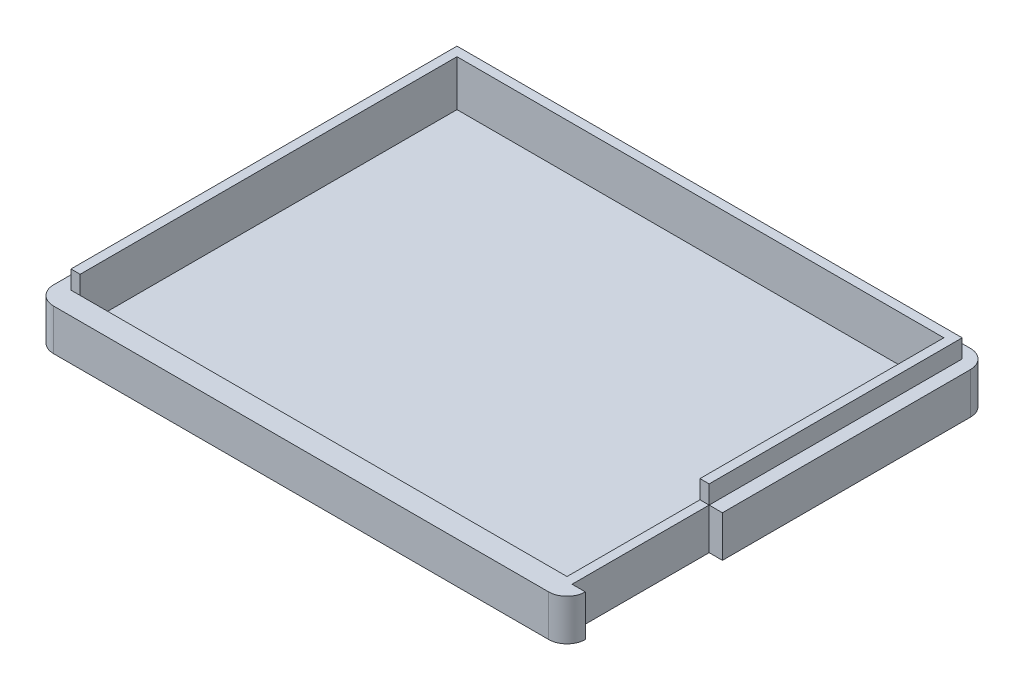
ISO-10303-21;
HEADER;
FILE_DESCRIPTION(('STEP AP214'),'2;1');
FILE_NAME('part.step','',(''),(''),'','','');
FILE_SCHEMA(('AUTOMOTIVE_DESIGN { 1 0 10303 214 1 1 1 1 }'));
ENDSEC;
DATA;
#1=APPLICATION_CONTEXT('core data for automotive mechanical design processes');
#2=APPLICATION_PROTOCOL_DEFINITION('international standard','automotive_design',2000,#1);
#3=PRODUCT_CONTEXT('',#1,'mechanical');
#4=PRODUCT('Part','Part','',(#3));
#5=PRODUCT_RELATED_PRODUCT_CATEGORY('part','',(#4));
#6=PRODUCT_DEFINITION_FORMATION('','',#4);
#7=PRODUCT_DEFINITION_CONTEXT('part definition',#1,'design');
#8=PRODUCT_DEFINITION('design','',#6,#7);
#9=PRODUCT_DEFINITION_SHAPE('','',#8);
#10=(LENGTH_UNIT() NAMED_UNIT(*) SI_UNIT(.MILLI.,.METRE.));
#11=(NAMED_UNIT(*) PLANE_ANGLE_UNIT() SI_UNIT($,.RADIAN.));
#12=(NAMED_UNIT(*) SI_UNIT($,.STERADIAN.) SOLID_ANGLE_UNIT());
#13=UNCERTAINTY_MEASURE_WITH_UNIT(LENGTH_MEASURE(1.E-05),#10,'distance_accuracy_value','');
#14=(GEOMETRIC_REPRESENTATION_CONTEXT(3) GLOBAL_UNCERTAINTY_ASSIGNED_CONTEXT((#13)) GLOBAL_UNIT_ASSIGNED_CONTEXT((#10,
#11,#12)) REPRESENTATION_CONTEXT('',''));
#15=CARTESIAN_POINT('',(0.,0.,0.));
#16=DIRECTION('',(0.,0.,1.));
#17=DIRECTION('',(1.,0.,0.));
#18=AXIS2_PLACEMENT_3D('',#15,#16,#17);
#19=CARTESIAN_POINT('',(0.,6.5,0.));
#20=DIRECTION('',(0.,1.,0.));
#21=DIRECTION('',(0.,0.,1.));
#22=AXIS2_PLACEMENT_3D('',#19,#20,#21);
#23=PLANE('',#22);
#24=DIRECTION('',(0.,0.,1.));
#25=VECTOR('',#24,1.);
#26=CARTESIAN_POINT('',(-24.6201030927835,6.5,-16.009793814433));
#27=LINE('',#26,#25);
#28=CARTESIAN_POINT('',(-24.6201030927835,6.5,-16.009793814433));
#29=VERTEX_POINT('',#28);
#30=CARTESIAN_POINT('',(-24.6201030927835,6.5,26.090206185567));
#31=VERTEX_POINT('',#30);
#32=EDGE_CURVE('E292',#29,#31,#27,.T.);
#33=ORIENTED_EDGE('',*,*,#32,.T.);
#34=DIRECTION('',(1.,0.,0.));
#35=VECTOR('',#34,1.);
#36=CARTESIAN_POINT('',(0.,6.5,26.090206185567));
#37=LINE('',#36,#35);
#38=CARTESIAN_POINT('',(-23.6201030927835,6.5,26.090206185567));
#39=VERTEX_POINT('',#38);
#40=EDGE_CURVE('E219',#31,#39,#37,.T.);
#41=ORIENTED_EDGE('',*,*,#40,.T.);
#42=DIRECTION('',(0.,0.,1.));
#43=VECTOR('',#42,1.);
#44=CARTESIAN_POINT('',(-23.6201030927835,6.5,-15.009793814433));
#45=LINE('',#44,#43);
#46=CARTESIAN_POINT('',(-23.6201030927835,6.5,-15.009793814433));
#47=VERTEX_POINT('',#46);
#48=EDGE_CURVE('E267',#47,#39,#45,.T.);
#49=ORIENTED_EDGE('',*,*,#48,.F.);
#50=DIRECTION('',(-1.,0.,0.));
#51=VECTOR('',#50,1.);
#52=CARTESIAN_POINT('',(-23.6201030927835,6.5,-15.009793814433));
#53=LINE('',#52,#51);
#54=CARTESIAN_POINT('',(29.4798969072165,6.5,-15.009793814433));
#55=VERTEX_POINT('',#54);
#56=EDGE_CURVE('E274',#55,#47,#53,.T.);
#57=ORIENTED_EDGE('',*,*,#56,.F.);
#58=DIRECTION('',(0.,0.,-1.));
#59=VECTOR('',#58,1.);
#60=CARTESIAN_POINT('',(29.4798969072165,6.5,-15.009793814433));
#61=LINE('',#60,#59);
#62=CARTESIAN_POINT('',(29.4798969072165,6.5,11.590206185567));
#63=VERTEX_POINT('',#62);
#64=EDGE_CURVE('E271',#63,#55,#61,.T.);
#65=ORIENTED_EDGE('',*,*,#64,.F.);
#66=DIRECTION('',(-1.,0.,0.));
#67=VECTOR('',#66,1.);
#68=CARTESIAN_POINT('',(30.4798969072165,6.5,11.590206185567));
#69=LINE('',#68,#67);
#70=CARTESIAN_POINT('',(30.4798969072165,6.5,11.590206185567));
#71=VERTEX_POINT('',#70);
#72=EDGE_CURVE('E234',#71,#63,#69,.T.);
#73=ORIENTED_EDGE('',*,*,#72,.F.);
#74=DIRECTION('',(0.,0.,-1.));
#75=VECTOR('',#74,1.);
#76=CARTESIAN_POINT('',(30.4798969072165,6.5,-16.009793814433));
#77=LINE('',#76,#75);
#78=CARTESIAN_POINT('',(30.4798969072165,6.5,-16.009793814433));
#79=VERTEX_POINT('',#78);
#80=EDGE_CURVE('E296',#71,#79,#77,.T.);
#81=ORIENTED_EDGE('',*,*,#80,.T.);
#82=DIRECTION('',(-1.,0.,0.));
#83=VECTOR('',#82,1.);
#84=CARTESIAN_POINT('',(-24.6201030927835,6.5,-16.009793814433));
#85=LINE('',#84,#83);
#86=EDGE_CURVE('E300',#79,#29,#85,.T.);
#87=ORIENTED_EDGE('',*,*,#86,.T.);
#88=EDGE_LOOP('',(#33,#41,#49,#57,#65,#73,#81,#87));
#89=FACE_BOUND('',#88,.T.);
#90=ADVANCED_FACE('F39',(#89),#23,.T.);
#91=CARTESIAN_POINT('',(-24.6201030927835,6.5,-16.009793814433));
#92=DIRECTION('',(1.,0.,0.));
#93=DIRECTION('',(0.,0.,-1.));
#94=AXIS2_PLACEMENT_3D('',#91,#92,#93);
#95=PLANE('',#94);
#96=DIRECTION('',(0.,1.,0.));
#97=VECTOR('',#96,1.);
#98=CARTESIAN_POINT('',(-24.6201030927835,4.5,26.090206185567));
#99=LINE('',#98,#97);
#100=CARTESIAN_POINT('',(-24.6201030927835,4.5,26.090206185567));
#101=VERTEX_POINT('',#100);
#102=EDGE_CURVE('E226',#101,#31,#99,.T.);
#103=ORIENTED_EDGE('',*,*,#102,.T.);
#104=ORIENTED_EDGE('',*,*,#32,.F.);
#105=DIRECTION('',(0.,-1.,0.));
#106=VECTOR('',#105,1.);
#107=CARTESIAN_POINT('',(-24.6201030927835,6.5,-16.009793814433));
#108=LINE('',#107,#106);
#109=CARTESIAN_POINT('',(-24.6201030927835,4.5,-16.009793814433));
#110=VERTEX_POINT('',#109);
#111=EDGE_CURVE('E303',#29,#110,#108,.T.);
#112=ORIENTED_EDGE('',*,*,#111,.T.);
#113=DIRECTION('',(0.,0.,1.));
#114=VECTOR('',#113,1.);
#115=CARTESIAN_POINT('',(-24.6201030927835,4.5,-16.009793814433));
#116=LINE('',#115,#114);
#117=EDGE_CURVE('E291',#110,#101,#116,.T.);
#118=ORIENTED_EDGE('',*,*,#117,.T.);
#119=EDGE_LOOP('',(#103,#104,#112,#118));
#120=FACE_BOUND('',#119,.T.);
#121=ADVANCED_FACE('F426',(#120),#95,.F.);
#122=CARTESIAN_POINT('',(0.,4.5,0.));
#123=DIRECTION('',(0.,-1.,0.));
#124=DIRECTION('',(0.,0.,-1.));
#125=AXIS2_PLACEMENT_3D('',#122,#123,#124);
#126=PLANE('',#125);
#127=DIRECTION('',(0.,0.,-1.));
#128=VECTOR('',#127,1.);
#129=CARTESIAN_POINT('',(30.4798969072165,4.5,-16.009793814433));
#130=LINE('',#129,#128);
#131=CARTESIAN_POINT('',(30.4798969072165,4.5,11.590206185567));
#132=VERTEX_POINT('',#131);
#133=CARTESIAN_POINT('',(30.4798969072165,4.5,-16.009793814433));
#134=VERTEX_POINT('',#133);
#135=EDGE_CURVE('E307',#132,#134,#130,.T.);
#136=ORIENTED_EDGE('',*,*,#135,.F.);
#137=DIRECTION('',(-1.,0.,0.));
#138=VECTOR('',#137,1.);
#139=CARTESIAN_POINT('',(30.4798969072165,4.5,11.590206185567));
#140=LINE('',#139,#138);
#141=CARTESIAN_POINT('',(31.9298969072165,4.5,11.590206185567));
#142=VERTEX_POINT('',#141);
#143=EDGE_CURVE('E203',#142,#132,#140,.T.);
#144=ORIENTED_EDGE('',*,*,#143,.F.);
#145=DIRECTION('',(0.,0.,-1.));
#146=VECTOR('',#145,1.);
#147=CARTESIAN_POINT('',(31.9298969072165,4.5,28.540206185567));
#148=LINE('',#147,#146);
#149=CARTESIAN_POINT('',(31.9298969072165,4.5,-15.459793814433));
#150=VERTEX_POINT('',#149);
#151=EDGE_CURVE('E330',#142,#150,#148,.T.);
#152=ORIENTED_EDGE('',*,*,#151,.T.);
#153=CARTESIAN_POINT('',(29.9298969072165,4.5,-15.459793814433));
#154=DIRECTION('',(0.,-1.,0.));
#155=DIRECTION('',(0.,0.,-1.));
#156=AXIS2_PLACEMENT_3D('',#153,#154,#155);
#157=CIRCLE('',#156,2.);
#158=CARTESIAN_POINT('',(29.9298969072165,4.5,-17.459793814433));
#159=VERTEX_POINT('',#158);
#160=EDGE_CURVE('E61',#150,#159,#157,.F.);
#161=ORIENTED_EDGE('',*,*,#160,.T.);
#162=DIRECTION('',(-1.,0.,0.));
#163=VECTOR('',#162,1.);
#164=CARTESIAN_POINT('',(-26.0701030927835,4.5,-17.459793814433));
#165=LINE('',#164,#163);
#166=CARTESIAN_POINT('',(-24.0701030927835,4.5,-17.459793814433));
#167=VERTEX_POINT('',#166);
#168=EDGE_CURVE('E333',#159,#167,#165,.T.);
#169=ORIENTED_EDGE('',*,*,#168,.T.);
#170=CARTESIAN_POINT('',(-24.0701030927835,4.5,-15.459793814433));
#171=DIRECTION('',(0.,-1.,0.));
#172=DIRECTION('',(0.,0.,-1.));
#173=AXIS2_PLACEMENT_3D('',#170,#171,#172);
#174=CIRCLE('',#173,2.);
#175=CARTESIAN_POINT('',(-26.0701030927835,4.5,-15.459793814433));
#176=VERTEX_POINT('',#175);
#177=EDGE_CURVE('E375',#167,#176,#174,.F.);
#178=ORIENTED_EDGE('',*,*,#177,.T.);
#179=DIRECTION('',(0.,0.,1.));
#180=VECTOR('',#179,1.);
#181=CARTESIAN_POINT('',(-26.0701030927835,4.5,28.540206185567));
#182=LINE('',#181,#180);
#183=CARTESIAN_POINT('',(-26.0701030927835,4.5,26.540206185567));
#184=VERTEX_POINT('',#183);
#185=EDGE_CURVE('E321',#176,#184,#182,.T.);
#186=ORIENTED_EDGE('',*,*,#185,.T.);
#187=CARTESIAN_POINT('',(-24.0701030927835,4.5,26.540206185567));
#188=DIRECTION('',(0.,-1.,0.));
#189=DIRECTION('',(0.,0.,-1.));
#190=AXIS2_PLACEMENT_3D('',#187,#188,#189);
#191=CIRCLE('',#190,2.);
#192=CARTESIAN_POINT('',(-24.0701030927835,4.5,28.540206185567));
#193=VERTEX_POINT('',#192);
#194=EDGE_CURVE('E384',#184,#193,#191,.F.);
#195=ORIENTED_EDGE('',*,*,#194,.T.);
#196=DIRECTION('',(1.,0.,0.));
#197=VECTOR('',#196,1.);
#198=CARTESIAN_POINT('',(-26.0701030927835,4.5,28.540206185567));
#199=LINE('',#198,#197);
#200=CARTESIAN_POINT('',(29.9298969072165,4.5,28.540206185567));
#201=VERTEX_POINT('',#200);
#202=EDGE_CURVE('E325',#193,#201,#199,.T.);
#203=ORIENTED_EDGE('',*,*,#202,.T.);
#204=CARTESIAN_POINT('',(29.9298969072165,4.5,26.540206185567));
#205=DIRECTION('',(0.,-1.,0.));
#206=DIRECTION('',(0.,0.,-1.));
#207=AXIS2_PLACEMENT_3D('',#204,#205,#206);
#208=CIRCLE('',#207,2.);
#209=CARTESIAN_POINT('',(31.9298969072165,4.5,26.540206185567));
#210=VERTEX_POINT('',#209);
#211=EDGE_CURVE('E380',#201,#210,#208,.F.);
#212=ORIENTED_EDGE('',*,*,#211,.T.);
#213=DIRECTION('',(1.,0.,0.));
#214=VECTOR('',#213,1.);
#215=CARTESIAN_POINT('',(30.4798969072165,4.5,26.540206185567));
#216=LINE('',#215,#214);
#217=CARTESIAN_POINT('',(30.4798969072165,4.5,26.540206185567));
#218=VERTEX_POINT('',#217);
#219=EDGE_CURVE('E207',#218,#210,#216,.T.);
#220=ORIENTED_EDGE('',*,*,#219,.F.);
#221=DIRECTION('',(0.,0.,1.));
#222=VECTOR('',#221,1.);
#223=CARTESIAN_POINT('',(30.4798969072165,4.5,11.590206185567));
#224=LINE('',#223,#222);
#225=EDGE_CURVE('E184',#132,#218,#224,.T.);
#226=ORIENTED_EDGE('',*,*,#225,.F.);
#227=DIRECTION('',(-1.,0.,0.));
#228=VECTOR('',#227,1.);
#229=CARTESIAN_POINT('',(30.4798969072165,4.5,11.590206185567));
#230=LINE('',#229,#228);
#231=CARTESIAN_POINT('',(29.4798969072165,4.5,11.590206185567));
#232=VERTEX_POINT('',#231);
#233=EDGE_CURVE('E235',#132,#232,#230,.T.);
#234=ORIENTED_EDGE('',*,*,#233,.T.);
#235=DIRECTION('',(0.,0.,1.));
#236=VECTOR('',#235,1.);
#237=CARTESIAN_POINT('',(29.4798969072165,4.5,27.090206185567));
#238=LINE('',#237,#236);
#239=CARTESIAN_POINT('',(29.4798969072165,4.5,26.090206185567));
#240=VERTEX_POINT('',#239);
#241=EDGE_CURVE('E238',#232,#240,#238,.T.);
#242=ORIENTED_EDGE('',*,*,#241,.T.);
#243=DIRECTION('',(1.,0.,0.));
#244=VECTOR('',#243,1.);
#245=CARTESIAN_POINT('',(0.,4.5,26.090206185567));
#246=LINE('',#245,#244);
#247=CARTESIAN_POINT('',(-23.6201030927835,4.5,26.090206185567));
#248=VERTEX_POINT('',#247);
#249=EDGE_CURVE('E227',#248,#240,#246,.T.);
#250=ORIENTED_EDGE('',*,*,#249,.F.);
#251=EDGE_CURVE('E222',#101,#248,#246,.T.);
#252=ORIENTED_EDGE('',*,*,#251,.F.);
#253=ORIENTED_EDGE('',*,*,#117,.F.);
#254=DIRECTION('',(-1.,0.,0.));
#255=VECTOR('',#254,1.);
#256=CARTESIAN_POINT('',(-24.6201030927835,4.5,-16.009793814433));
#257=LINE('',#256,#255);
#258=EDGE_CURVE('E297',#134,#110,#257,.T.);
#259=ORIENTED_EDGE('',*,*,#258,.F.);
#260=EDGE_LOOP('',(#136,#144,#152,#161,#169,#178,#186,#195,#203,#212,#220,#226,#234,#242,#250,
#252,#253,#259));
#261=FACE_BOUND('',#260,.T.);
#262=ADVANCED_FACE('F404',(#261),#126,.F.);
#263=CARTESIAN_POINT('',(-26.0701030927835,4.5,28.540206185567));
#264=DIRECTION('',(1.,0.,0.));
#265=DIRECTION('',(0.,0.,-1.));
#266=AXIS2_PLACEMENT_3D('',#263,#264,#265);
#267=PLANE('',#266);
#268=DIRECTION('',(0.,0.,1.));
#269=VECTOR('',#268,1.);
#270=CARTESIAN_POINT('',(-26.0701030927835,0.,28.540206185567));
#271=LINE('',#270,#269);
#272=CARTESIAN_POINT('',(-26.0701030927835,0.,-15.459793814433));
#273=VERTEX_POINT('',#272);
#274=CARTESIAN_POINT('',(-26.0701030927835,0.,26.540206185567));
#275=VERTEX_POINT('',#274);
#276=EDGE_CURVE('E320',#273,#275,#271,.T.);
#277=ORIENTED_EDGE('',*,*,#276,.T.);
#278=DIRECTION('',(0.,-1.,0.));
#279=VECTOR('',#278,1.);
#280=CARTESIAN_POINT('',(-26.0701030927835,4.5,26.540206185567));
#281=LINE('',#280,#279);
#282=EDGE_CURVE('E372',#275,#184,#281,.F.);
#283=ORIENTED_EDGE('',*,*,#282,.T.);
#284=ORIENTED_EDGE('',*,*,#185,.F.);
#285=DIRECTION('',(0.,-1.,0.));
#286=VECTOR('',#285,1.);
#287=CARTESIAN_POINT('',(-26.0701030927835,4.5,-15.459793814433));
#288=LINE('',#287,#286);
#289=EDGE_CURVE('E368',#176,#273,#288,.T.);
#290=ORIENTED_EDGE('',*,*,#289,.T.);
#291=EDGE_LOOP('',(#277,#283,#284,#290));
#292=FACE_BOUND('',#291,.T.);
#293=ADVANCED_FACE('F453',(#292),#267,.F.);
#294=CARTESIAN_POINT('',(-26.0701030927835,4.5,28.540206185567));
#295=DIRECTION('',(0.,0.,-1.));
#296=DIRECTION('',(-1.,0.,0.));
#297=AXIS2_PLACEMENT_3D('',#294,#295,#296);
#298=PLANE('',#297);
#299=ORIENTED_EDGE('',*,*,#202,.F.);
#300=DIRECTION('',(0.,-1.,0.));
#301=VECTOR('',#300,1.);
#302=CARTESIAN_POINT('',(-24.0701030927835,4.5,28.540206185567));
#303=LINE('',#302,#301);
#304=CARTESIAN_POINT('',(-24.0701030927835,0.,28.540206185567));
#305=VERTEX_POINT('',#304);
#306=EDGE_CURVE('E351',#193,#305,#303,.T.);
#307=ORIENTED_EDGE('',*,*,#306,.T.);
#308=DIRECTION('',(1.,0.,0.));
#309=VECTOR('',#308,1.);
#310=CARTESIAN_POINT('',(-26.0701030927835,0.,28.540206185567));
#311=LINE('',#310,#309);
#312=CARTESIAN_POINT('',(29.9298969072165,0.,28.540206185567));
#313=VERTEX_POINT('',#312);
#314=EDGE_CURVE('E340',#305,#313,#311,.T.);
#315=ORIENTED_EDGE('',*,*,#314,.T.);
#316=DIRECTION('',(0.,-1.,0.));
#317=VECTOR('',#316,1.);
#318=CARTESIAN_POINT('',(29.9298969072165,4.5,28.540206185567));
#319=LINE('',#318,#317);
#320=EDGE_CURVE('E336',#313,#201,#319,.F.);
#321=ORIENTED_EDGE('',*,*,#320,.T.);
#322=EDGE_LOOP('',(#299,#307,#315,#321));
#323=FACE_BOUND('',#322,.T.);
#324=ADVANCED_FACE('F462',(#323),#298,.F.);
#325=CARTESIAN_POINT('',(31.9298969072165,4.5,28.540206185567));
#326=DIRECTION('',(-1.,0.,0.));
#327=DIRECTION('',(0.,0.,1.));
#328=AXIS2_PLACEMENT_3D('',#325,#326,#327);
#329=PLANE('',#328);
#330=ORIENTED_EDGE('',*,*,#151,.F.);
#331=DIRECTION('',(0.,1.,0.));
#332=VECTOR('',#331,1.);
#333=CARTESIAN_POINT('',(31.9298969072165,0.,11.590206185567));
#334=LINE('',#333,#332);
#335=CARTESIAN_POINT('',(31.9298969072165,0.,11.590206185567));
#336=VERTEX_POINT('',#335);
#337=EDGE_CURVE('E188',#336,#142,#334,.T.);
#338=ORIENTED_EDGE('',*,*,#337,.F.);
#339=DIRECTION('',(0.,0.,-1.));
#340=VECTOR('',#339,1.);
#341=CARTESIAN_POINT('',(31.9298969072165,0.,28.540206185567));
#342=LINE('',#341,#340);
#343=CARTESIAN_POINT('',(31.9298969072165,0.,-15.459793814433));
#344=VERTEX_POINT('',#343);
#345=EDGE_CURVE('E344',#336,#344,#342,.T.);
#346=ORIENTED_EDGE('',*,*,#345,.T.);
#347=DIRECTION('',(0.,-1.,0.));
#348=VECTOR('',#347,1.);
#349=CARTESIAN_POINT('',(31.9298969072165,4.5,-15.459793814433));
#350=LINE('',#349,#348);
#351=EDGE_CURVE('E387',#344,#150,#350,.F.);
#352=ORIENTED_EDGE('',*,*,#351,.T.);
#353=EDGE_LOOP('',(#330,#338,#346,#352));
#354=FACE_BOUND('',#353,.T.);
#355=ADVANCED_FACE('F440',(#354),#329,.F.);
#356=CARTESIAN_POINT('',(-26.0701030927835,4.5,-17.459793814433));
#357=DIRECTION('',(0.,0.,1.));
#358=DIRECTION('',(1.,0.,0.));
#359=AXIS2_PLACEMENT_3D('',#356,#357,#358);
#360=PLANE('',#359);
#361=ORIENTED_EDGE('',*,*,#168,.F.);
#362=DIRECTION('',(0.,-1.,0.));
#363=VECTOR('',#362,1.);
#364=CARTESIAN_POINT('',(29.9298969072165,4.5,-17.459793814433));
#365=LINE('',#364,#363);
#366=CARTESIAN_POINT('',(29.9298969072165,0.,-17.459793814433));
#367=VERTEX_POINT('',#366);
#368=EDGE_CURVE('E11',#159,#367,#365,.T.);
#369=ORIENTED_EDGE('',*,*,#368,.T.);
#370=DIRECTION('',(-1.,0.,0.));
#371=VECTOR('',#370,1.);
#372=CARTESIAN_POINT('',(-26.0701030927835,0.,-17.459793814433));
#373=LINE('',#372,#371);
#374=CARTESIAN_POINT('',(-24.0701030927835,0.,-17.459793814433));
#375=VERTEX_POINT('',#374);
#376=EDGE_CURVE('E326',#367,#375,#373,.T.);
#377=ORIENTED_EDGE('',*,*,#376,.T.);
#378=DIRECTION('',(0.,-1.,0.));
#379=VECTOR('',#378,1.);
#380=CARTESIAN_POINT('',(-24.0701030927835,4.5,-17.459793814433));
#381=LINE('',#380,#379);
#382=EDGE_CURVE('E48',#375,#167,#381,.F.);
#383=ORIENTED_EDGE('',*,*,#382,.T.);
#384=EDGE_LOOP('',(#361,#369,#377,#383));
#385=FACE_BOUND('',#384,.T.);
#386=ADVANCED_FACE('F446',(#385),#360,.F.);
#387=CARTESIAN_POINT('',(0.,0.,0.));
#388=DIRECTION('',(0.,-1.,0.));
#389=DIRECTION('',(0.,0.,-1.));
#390=AXIS2_PLACEMENT_3D('',#387,#388,#389);
#391=PLANE('',#390);
#392=DIRECTION('',(-1.,0.,0.));
#393=VECTOR('',#392,1.);
#394=CARTESIAN_POINT('',(30.4798969072165,0.,11.590206185567));
#395=LINE('',#394,#393);
#396=CARTESIAN_POINT('',(30.4798969072165,0.,11.590206185567));
#397=VERTEX_POINT('',#396);
#398=EDGE_CURVE('E189',#336,#397,#395,.T.);
#399=ORIENTED_EDGE('',*,*,#398,.T.);
#400=DIRECTION('',(0.,0.,1.));
#401=VECTOR('',#400,1.);
#402=CARTESIAN_POINT('',(30.4798969072165,0.,11.590206185567));
#403=LINE('',#402,#401);
#404=CARTESIAN_POINT('',(30.4798969072165,0.,26.540206185567));
#405=VERTEX_POINT('',#404);
#406=EDGE_CURVE('E181',#397,#405,#403,.T.);
#407=ORIENTED_EDGE('',*,*,#406,.T.);
#408=DIRECTION('',(1.,0.,0.));
#409=VECTOR('',#408,1.);
#410=CARTESIAN_POINT('',(30.4798969072165,0.,26.540206185567));
#411=LINE('',#410,#409);
#412=CARTESIAN_POINT('',(31.9298969072165,0.,26.540206185567));
#413=VERTEX_POINT('',#412);
#414=EDGE_CURVE('E192',#405,#413,#411,.T.);
#415=ORIENTED_EDGE('',*,*,#414,.T.);
#416=CARTESIAN_POINT('',(29.9298969072165,0.,26.540206185567));
#417=DIRECTION('',(0.,-1.,0.));
#418=DIRECTION('',(0.,0.,-1.));
#419=AXIS2_PLACEMENT_3D('',#416,#417,#418);
#420=CIRCLE('',#419,2.);
#421=EDGE_CURVE('E362',#413,#313,#420,.T.);
#422=ORIENTED_EDGE('',*,*,#421,.T.);
#423=ORIENTED_EDGE('',*,*,#314,.F.);
#424=CARTESIAN_POINT('',(-24.0701030927835,0.,26.540206185567));
#425=DIRECTION('',(0.,-1.,0.));
#426=DIRECTION('',(0.,0.,-1.));
#427=AXIS2_PLACEMENT_3D('',#424,#425,#426);
#428=CIRCLE('',#427,2.);
#429=EDGE_CURVE('E365',#305,#275,#428,.T.);
#430=ORIENTED_EDGE('',*,*,#429,.T.);
#431=ORIENTED_EDGE('',*,*,#276,.F.);
#432=CARTESIAN_POINT('',(-24.0701030927835,0.,-15.459793814433));
#433=DIRECTION('',(0.,-1.,0.));
#434=DIRECTION('',(0.,0.,-1.));
#435=AXIS2_PLACEMENT_3D('',#432,#433,#434);
#436=CIRCLE('',#435,2.);
#437=EDGE_CURVE('E355',#273,#375,#436,.T.);
#438=ORIENTED_EDGE('',*,*,#437,.T.);
#439=ORIENTED_EDGE('',*,*,#376,.F.);
#440=CARTESIAN_POINT('',(29.9298969072165,0.,-15.459793814433));
#441=DIRECTION('',(0.,-1.,0.));
#442=DIRECTION('',(0.,0.,-1.));
#443=AXIS2_PLACEMENT_3D('',#440,#441,#442);
#444=CIRCLE('',#443,2.);
#445=EDGE_CURVE('E358',#367,#344,#444,.T.);
#446=ORIENTED_EDGE('',*,*,#445,.T.);
#447=ORIENTED_EDGE('',*,*,#345,.F.);
#448=EDGE_LOOP('',(#399,#407,#415,#422,#423,#430,#431,#438,#439,#446,#447));
#449=FACE_BOUND('',#448,.T.);
#450=ADVANCED_FACE('F200',(#449),#391,.T.);
#451=CARTESIAN_POINT('',(30.4798969072165,6.5,-16.009793814433));
#452=DIRECTION('',(-1.,0.,0.));
#453=DIRECTION('',(0.,0.,1.));
#454=AXIS2_PLACEMENT_3D('',#451,#452,#453);
#455=PLANE('',#454);
#456=ORIENTED_EDGE('',*,*,#80,.F.);
#457=DIRECTION('',(0.,1.,0.));
#458=VECTOR('',#457,1.);
#459=CARTESIAN_POINT('',(30.4798969072165,4.5,11.590206185567));
#460=LINE('',#459,#458);
#461=EDGE_CURVE('E242',#132,#71,#460,.T.);
#462=ORIENTED_EDGE('',*,*,#461,.F.);
#463=ORIENTED_EDGE('',*,*,#135,.T.);
#464=DIRECTION('',(0.,-1.,0.));
#465=VECTOR('',#464,1.);
#466=CARTESIAN_POINT('',(30.4798969072165,6.5,-16.009793814433));
#467=LINE('',#466,#465);
#468=EDGE_CURVE('E316',#79,#134,#467,.T.);
#469=ORIENTED_EDGE('',*,*,#468,.F.);
#470=EDGE_LOOP('',(#456,#462,#463,#469));
#471=FACE_BOUND('',#470,.T.);
#472=ADVANCED_FACE('F433',(#471),#455,.F.);
#473=CARTESIAN_POINT('',(-24.6201030927835,6.5,-16.009793814433));
#474=DIRECTION('',(0.,0.,1.));
#475=DIRECTION('',(1.,0.,0.));
#476=AXIS2_PLACEMENT_3D('',#473,#474,#475);
#477=PLANE('',#476);
#478=ORIENTED_EDGE('',*,*,#258,.T.);
#479=ORIENTED_EDGE('',*,*,#111,.F.);
#480=ORIENTED_EDGE('',*,*,#86,.F.);
#481=ORIENTED_EDGE('',*,*,#468,.T.);
#482=EDGE_LOOP('',(#478,#479,#480,#481));
#483=FACE_BOUND('',#482,.T.);
#484=ADVANCED_FACE('F429',(#483),#477,.F.);
#485=CARTESIAN_POINT('',(-23.6201030927835,6.5,-15.009793814433));
#486=DIRECTION('',(1.,0.,0.));
#487=DIRECTION('',(0.,0.,-1.));
#488=AXIS2_PLACEMENT_3D('',#485,#486,#487);
#489=PLANE('',#488);
#490=DIRECTION('',(0.,-1.,0.));
#491=VECTOR('',#490,1.);
#492=CARTESIAN_POINT('',(-23.6201030927835,6.5,26.090206185567));
#493=LINE('',#492,#491);
#494=EDGE_CURVE('E287',#39,#248,#493,.T.);
#495=ORIENTED_EDGE('',*,*,#494,.T.);
#496=CARTESIAN_POINT('',(-23.6201030927835,1.5,26.090206185567));
#497=VERTEX_POINT('',#496);
#498=EDGE_CURVE('E286',#248,#497,#493,.T.);
#499=ORIENTED_EDGE('',*,*,#498,.T.);
#500=DIRECTION('',(0.,0.,1.));
#501=VECTOR('',#500,1.);
#502=CARTESIAN_POINT('',(-23.6201030927835,1.5,26.090206185567));
#503=LINE('',#502,#501);
#504=CARTESIAN_POINT('',(-23.6201030927835,1.5,-15.009793814433));
#505=VERTEX_POINT('',#504);
#506=EDGE_CURVE('E249',#505,#497,#503,.T.);
#507=ORIENTED_EDGE('',*,*,#506,.F.);
#508=DIRECTION('',(0.,-1.,0.));
#509=VECTOR('',#508,1.);
#510=CARTESIAN_POINT('',(-23.6201030927835,6.5,-15.009793814433));
#511=LINE('',#510,#509);
#512=EDGE_CURVE('E277',#47,#505,#511,.T.);
#513=ORIENTED_EDGE('',*,*,#512,.F.);
#514=ORIENTED_EDGE('',*,*,#48,.T.);
#515=EDGE_LOOP('',(#495,#499,#507,#513,#514));
#516=FACE_BOUND('',#515,.T.);
#517=ADVANCED_FACE('F416',(#516),#489,.T.);
#518=CARTESIAN_POINT('',(-23.6201030927835,6.5,26.090206185567));
#519=DIRECTION('',(0.,0.,-1.));
#520=DIRECTION('',(-1.,0.,0.));
#521=AXIS2_PLACEMENT_3D('',#518,#519,#520);
#522=PLANE('',#521);
#523=ORIENTED_EDGE('',*,*,#249,.T.);
#524=DIRECTION('',(0.,-1.,0.));
#525=VECTOR('',#524,1.);
#526=CARTESIAN_POINT('',(29.4798969072165,6.5,26.090206185567));
#527=LINE('',#526,#525);
#528=CARTESIAN_POINT('',(29.4798969072165,1.5,26.090206185567));
#529=VERTEX_POINT('',#528);
#530=EDGE_CURVE('E283',#240,#529,#527,.T.);
#531=ORIENTED_EDGE('',*,*,#530,.T.);
#532=DIRECTION('',(1.,0.,0.));
#533=VECTOR('',#532,1.);
#534=CARTESIAN_POINT('',(-23.6201030927835,1.5,26.090206185567));
#535=LINE('',#534,#533);
#536=EDGE_CURVE('E255',#497,#529,#535,.T.);
#537=ORIENTED_EDGE('',*,*,#536,.F.);
#538=ORIENTED_EDGE('',*,*,#498,.F.);
#539=EDGE_LOOP('',(#523,#531,#537,#538));
#540=FACE_BOUND('',#539,.T.);
#541=ADVANCED_FACE('F397',(#540),#522,.T.);
#542=CARTESIAN_POINT('',(29.4798969072165,6.5,-15.009793814433));
#543=DIRECTION('',(-1.,0.,0.));
#544=DIRECTION('',(0.,0.,1.));
#545=AXIS2_PLACEMENT_3D('',#542,#543,#544);
#546=PLANE('',#545);
#547=DIRECTION('',(0.,1.,0.));
#548=VECTOR('',#547,1.);
#549=CARTESIAN_POINT('',(29.4798969072165,4.5,11.590206185567));
#550=LINE('',#549,#548);
#551=EDGE_CURVE('E245',#232,#63,#550,.T.);
#552=ORIENTED_EDGE('',*,*,#551,.T.);
#553=ORIENTED_EDGE('',*,*,#64,.T.);
#554=DIRECTION('',(0.,-1.,0.));
#555=VECTOR('',#554,1.);
#556=CARTESIAN_POINT('',(29.4798969072165,6.5,-15.009793814433));
#557=LINE('',#556,#555);
#558=CARTESIAN_POINT('',(29.4798969072165,1.5,-15.009793814433));
#559=VERTEX_POINT('',#558);
#560=EDGE_CURVE('E280',#55,#559,#557,.T.);
#561=ORIENTED_EDGE('',*,*,#560,.T.);
#562=DIRECTION('',(0.,0.,-1.));
#563=VECTOR('',#562,1.);
#564=CARTESIAN_POINT('',(29.4798969072165,1.5,26.090206185567));
#565=LINE('',#564,#563);
#566=EDGE_CURVE('E259',#529,#559,#565,.T.);
#567=ORIENTED_EDGE('',*,*,#566,.F.);
#568=ORIENTED_EDGE('',*,*,#530,.F.);
#569=ORIENTED_EDGE('',*,*,#241,.F.);
#570=EDGE_LOOP('',(#552,#553,#561,#567,#568,#569));
#571=FACE_BOUND('',#570,.T.);
#572=ADVANCED_FACE('F408',(#571),#546,.T.);
#573=CARTESIAN_POINT('',(-23.6201030927835,6.5,-15.009793814433));
#574=DIRECTION('',(0.,0.,1.));
#575=DIRECTION('',(1.,0.,0.));
#576=AXIS2_PLACEMENT_3D('',#573,#574,#575);
#577=PLANE('',#576);
#578=ORIENTED_EDGE('',*,*,#512,.T.);
#579=DIRECTION('',(-1.,0.,0.));
#580=VECTOR('',#579,1.);
#581=CARTESIAN_POINT('',(-23.6201030927835,1.5,-15.009793814433));
#582=LINE('',#581,#580);
#583=EDGE_CURVE('E263',#559,#505,#582,.T.);
#584=ORIENTED_EDGE('',*,*,#583,.F.);
#585=ORIENTED_EDGE('',*,*,#560,.F.);
#586=ORIENTED_EDGE('',*,*,#56,.T.);
#587=EDGE_LOOP('',(#578,#584,#585,#586));
#588=FACE_BOUND('',#587,.T.);
#589=ADVANCED_FACE('F472',(#588),#577,.T.);
#590=CARTESIAN_POINT('',(0.,1.5,0.));
#591=DIRECTION('',(0.,-1.,0.));
#592=DIRECTION('',(0.,0.,-1.));
#593=AXIS2_PLACEMENT_3D('',#590,#591,#592);
#594=PLANE('',#593);
#595=ORIENTED_EDGE('',*,*,#506,.T.);
#596=ORIENTED_EDGE('',*,*,#536,.T.);
#597=ORIENTED_EDGE('',*,*,#566,.T.);
#598=ORIENTED_EDGE('',*,*,#583,.T.);
#599=EDGE_LOOP('',(#595,#596,#597,#598));
#600=FACE_BOUND('',#599,.T.);
#601=ADVANCED_FACE('F412',(#600),#594,.F.);
#602=CARTESIAN_POINT('',(30.4798969072165,4.5,11.590206185567));
#603=DIRECTION('',(0.,0.,-1.));
#604=DIRECTION('',(-1.,0.,0.));
#605=AXIS2_PLACEMENT_3D('',#602,#603,#604);
#606=PLANE('',#605);
#607=ORIENTED_EDGE('',*,*,#72,.T.);
#608=ORIENTED_EDGE('',*,*,#551,.F.);
#609=ORIENTED_EDGE('',*,*,#233,.F.);
#610=ORIENTED_EDGE('',*,*,#461,.T.);
#611=EDGE_LOOP('',(#607,#608,#609,#610));
#612=FACE_BOUND('',#611,.T.);
#613=ADVANCED_FACE('F468',(#612),#606,.F.);
#614=CARTESIAN_POINT('',(0.,4.5,26.090206185567));
#615=DIRECTION('',(0.,0.,1.));
#616=DIRECTION('',(1.,0.,0.));
#617=AXIS2_PLACEMENT_3D('',#614,#615,#616);
#618=PLANE('',#617);
#619=ORIENTED_EDGE('',*,*,#40,.F.);
#620=ORIENTED_EDGE('',*,*,#102,.F.);
#621=ORIENTED_EDGE('',*,*,#251,.T.);
#622=ORIENTED_EDGE('',*,*,#494,.F.);
#623=EDGE_LOOP('',(#619,#620,#621,#622));
#624=FACE_BOUND('',#623,.T.);
#625=ADVANCED_FACE('F419',(#624),#618,.T.);
#626=CARTESIAN_POINT('',(-24.0701030927835,4.5,26.540206185567));
#627=DIRECTION('',(0.,-1.,0.));
#628=DIRECTION('',(0.,0.,-1.));
#629=AXIS2_PLACEMENT_3D('',#626,#627,#628);
#630=CYLINDRICAL_SURFACE('',#629,2.);
#631=ORIENTED_EDGE('',*,*,#194,.F.);
#632=ORIENTED_EDGE('',*,*,#282,.F.);
#633=ORIENTED_EDGE('',*,*,#429,.F.);
#634=ORIENTED_EDGE('',*,*,#306,.F.);
#635=EDGE_LOOP('',(#631,#632,#633,#634));
#636=FACE_BOUND('',#635,.T.);
#637=ADVANCED_FACE('F459',(#636),#630,.T.);
#638=CARTESIAN_POINT('',(29.9298969072165,4.5,26.540206185567));
#639=DIRECTION('',(0.,-1.,0.));
#640=DIRECTION('',(0.,0.,-1.));
#641=AXIS2_PLACEMENT_3D('',#638,#639,#640);
#642=CYLINDRICAL_SURFACE('',#641,2.);
#643=ORIENTED_EDGE('',*,*,#211,.F.);
#644=ORIENTED_EDGE('',*,*,#320,.F.);
#645=ORIENTED_EDGE('',*,*,#421,.F.);
#646=DIRECTION('',(0.,-1.,0.));
#647=VECTOR('',#646,1.);
#648=CARTESIAN_POINT('',(31.9298969072165,4.5,26.540206185567));
#649=LINE('',#648,#647);
#650=EDGE_CURVE('E195',#210,#413,#649,.T.);
#651=ORIENTED_EDGE('',*,*,#650,.F.);
#652=EDGE_LOOP('',(#643,#644,#645,#651));
#653=FACE_BOUND('',#652,.T.);
#654=ADVANCED_FACE('F466',(#653),#642,.T.);
#655=CARTESIAN_POINT('',(29.9298969072165,4.5,-15.459793814433));
#656=DIRECTION('',(0.,-1.,0.));
#657=DIRECTION('',(0.,0.,-1.));
#658=AXIS2_PLACEMENT_3D('',#655,#656,#657);
#659=CYLINDRICAL_SURFACE('',#658,2.);
#660=ORIENTED_EDGE('',*,*,#160,.F.);
#661=ORIENTED_EDGE('',*,*,#351,.F.);
#662=ORIENTED_EDGE('',*,*,#445,.F.);
#663=ORIENTED_EDGE('',*,*,#368,.F.);
#664=EDGE_LOOP('',(#660,#661,#662,#663));
#665=FACE_BOUND('',#664,.T.);
#666=ADVANCED_FACE('F444',(#665),#659,.T.);
#667=CARTESIAN_POINT('',(-24.0701030927835,4.5,-15.459793814433));
#668=DIRECTION('',(0.,-1.,0.));
#669=DIRECTION('',(0.,0.,-1.));
#670=AXIS2_PLACEMENT_3D('',#667,#668,#669);
#671=CYLINDRICAL_SURFACE('',#670,2.);
#672=ORIENTED_EDGE('',*,*,#177,.F.);
#673=ORIENTED_EDGE('',*,*,#382,.F.);
#674=ORIENTED_EDGE('',*,*,#437,.F.);
#675=ORIENTED_EDGE('',*,*,#289,.F.);
#676=EDGE_LOOP('',(#672,#673,#674,#675));
#677=FACE_BOUND('',#676,.T.);
#678=ADVANCED_FACE('F41',(#677),#671,.T.);
#679=CARTESIAN_POINT('',(30.4798969072165,0.,11.590206185567));
#680=DIRECTION('',(-1.,0.,0.));
#681=DIRECTION('',(0.,0.,1.));
#682=AXIS2_PLACEMENT_3D('',#679,#680,#681);
#683=PLANE('',#682);
#684=ORIENTED_EDGE('',*,*,#225,.T.);
#685=DIRECTION('',(0.,1.,0.));
#686=VECTOR('',#685,1.);
#687=CARTESIAN_POINT('',(30.4798969072165,0.,26.540206185567));
#688=LINE('',#687,#686);
#689=EDGE_CURVE('E177',#405,#218,#688,.T.);
#690=ORIENTED_EDGE('',*,*,#689,.F.);
#691=ORIENTED_EDGE('',*,*,#406,.F.);
#692=DIRECTION('',(0.,1.,0.));
#693=VECTOR('',#692,1.);
#694=CARTESIAN_POINT('',(30.4798969072165,0.,11.590206185567));
#695=LINE('',#694,#693);
#696=EDGE_CURVE('E216',#397,#132,#695,.T.);
#697=ORIENTED_EDGE('',*,*,#696,.T.);
#698=EDGE_LOOP('',(#684,#690,#691,#697));
#699=FACE_BOUND('',#698,.T.);
#700=ADVANCED_FACE('F179',(#699),#683,.F.);
#701=CARTESIAN_POINT('',(30.4798969072165,0.,11.590206185567));
#702=DIRECTION('',(0.,0.,-1.));
#703=DIRECTION('',(-1.,0.,0.));
#704=AXIS2_PLACEMENT_3D('',#701,#702,#703);
#705=PLANE('',#704);
#706=ORIENTED_EDGE('',*,*,#143,.T.);
#707=ORIENTED_EDGE('',*,*,#696,.F.);
#708=ORIENTED_EDGE('',*,*,#398,.F.);
#709=ORIENTED_EDGE('',*,*,#337,.T.);
#710=EDGE_LOOP('',(#706,#707,#708,#709));
#711=FACE_BOUND('',#710,.T.);
#712=ADVANCED_FACE('F516',(#711),#705,.F.);
#713=CARTESIAN_POINT('',(30.4798969072165,0.,26.540206185567));
#714=DIRECTION('',(0.,0.,1.));
#715=DIRECTION('',(1.,0.,0.));
#716=AXIS2_PLACEMENT_3D('',#713,#714,#715);
#717=PLANE('',#716);
#718=ORIENTED_EDGE('',*,*,#219,.T.);
#719=ORIENTED_EDGE('',*,*,#650,.T.);
#720=ORIENTED_EDGE('',*,*,#414,.F.);
#721=ORIENTED_EDGE('',*,*,#689,.T.);
#722=EDGE_LOOP('',(#718,#719,#720,#721));
#723=FACE_BOUND('',#722,.T.);
#724=ADVANCED_FACE('F193',(#723),#717,.F.);
#725=CLOSED_SHELL('',(#90,#121,#262,#293,#324,#355,#386,#450,#472,#484,#517,#541,#572,#589,#601,
#613,#625,#637,#654,#666,#678,#700,#712,#724));
#726=MANIFOLD_SOLID_BREP('B2',#725);
#727=ADVANCED_BREP_SHAPE_REPRESENTATION('',(#18,#726),#14);
#728=SHAPE_DEFINITION_REPRESENTATION(#9,#727);
ENDSEC;
END-ISO-10303-21;
